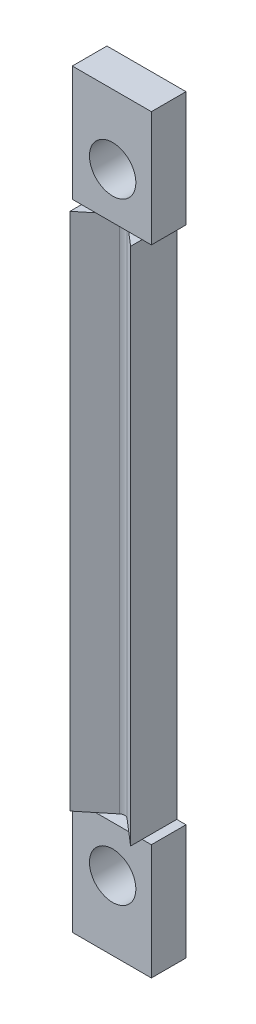
ISO-10303-21;
HEADER;
FILE_DESCRIPTION(('STEP AP214'),'2;1');
FILE_NAME('part.step','',(''),(''),'','','');
FILE_SCHEMA(('AUTOMOTIVE_DESIGN { 1 0 10303 214 1 1 1 1 }'));
ENDSEC;
DATA;
#1=APPLICATION_CONTEXT('core data for automotive mechanical design processes');
#2=APPLICATION_PROTOCOL_DEFINITION('international standard','automotive_design',2000,#1);
#3=PRODUCT_CONTEXT('',#1,'mechanical');
#4=PRODUCT('Part','Part','',(#3));
#5=PRODUCT_RELATED_PRODUCT_CATEGORY('part','',(#4));
#6=PRODUCT_DEFINITION_FORMATION('','',#4);
#7=PRODUCT_DEFINITION_CONTEXT('part definition',#1,'design');
#8=PRODUCT_DEFINITION('design','',#6,#7);
#9=PRODUCT_DEFINITION_SHAPE('','',#8);
#10=(LENGTH_UNIT() NAMED_UNIT(*) SI_UNIT(.MILLI.,.METRE.));
#11=(NAMED_UNIT(*) PLANE_ANGLE_UNIT() SI_UNIT($,.RADIAN.));
#12=(NAMED_UNIT(*) SI_UNIT($,.STERADIAN.) SOLID_ANGLE_UNIT());
#13=UNCERTAINTY_MEASURE_WITH_UNIT(LENGTH_MEASURE(1.E-05),#10,'distance_accuracy_value','');
#14=(GEOMETRIC_REPRESENTATION_CONTEXT(3) GLOBAL_UNCERTAINTY_ASSIGNED_CONTEXT((#13)) GLOBAL_UNIT_ASSIGNED_CONTEXT((#10,
#11,#12)) REPRESENTATION_CONTEXT('',''));
#15=CARTESIAN_POINT('',(0.,0.,0.));
#16=DIRECTION('',(0.,0.,1.));
#17=DIRECTION('',(1.,0.,0.));
#18=AXIS2_PLACEMENT_3D('',#15,#16,#17);
#19=CARTESIAN_POINT('',(0.,-22.5,0.));
#20=DIRECTION('',(0.,-1.,0.));
#21=DIRECTION('',(0.,0.,-1.));
#22=AXIS2_PLACEMENT_3D('',#19,#20,#21);
#23=PLANE('',#22);
#24=DIRECTION('',(-1.,0.,0.));
#25=VECTOR('',#24,1.);
#26=CARTESIAN_POINT('',(-3.49457677044796,-22.5,1.2));
#27=LINE('',#26,#25);
#28=CARTESIAN_POINT('',(2.55542322955204,-22.5,1.2));
#29=VERTEX_POINT('',#28);
#30=CARTESIAN_POINT('',(1.39386721611929,-22.5,1.2));
#31=VERTEX_POINT('',#30);
#32=EDGE_CURVE('E272',#29,#31,#27,.T.);
#33=ORIENTED_EDGE('',*,*,#32,.F.);
#34=DIRECTION('',(0.,0.,-1.));
#35=VECTOR('',#34,1.);
#36=CARTESIAN_POINT('',(2.55542322955204,-22.5,-1.8));
#37=LINE('',#36,#35);
#38=CARTESIAN_POINT('',(2.55542322955204,-22.5,2.2));
#39=VERTEX_POINT('',#38);
#40=EDGE_CURVE('E250',#39,#29,#37,.T.);
#41=ORIENTED_EDGE('',*,*,#40,.F.);
#42=DIRECTION('',(0.757842606160636,0.,0.652437417908918));
#43=VECTOR('',#42,1.);
#44=CARTESIAN_POINT('',(0.,-22.5,0.));
#45=LINE('',#44,#43);
#46=EDGE_CURVE('E231',#31,#39,#45,.T.);
#47=ORIENTED_EDGE('',*,*,#46,.F.);
#48=EDGE_LOOP('',(#33,#41,#47));
#49=FACE_BOUND('',#48,.T.);
#50=ADVANCED_FACE('F37',(#49),#23,.T.);
#51=CARTESIAN_POINT('',(0.,22.5,0.));
#52=DIRECTION('',(0.,-1.,0.));
#53=DIRECTION('',(0.,0.,-1.));
#54=AXIS2_PLACEMENT_3D('',#51,#52,#53);
#55=PLANE('',#54);
#56=DIRECTION('',(1.,0.,0.));
#57=VECTOR('',#56,1.);
#58=CARTESIAN_POINT('',(-3.49457677044796,22.5,1.2));
#59=LINE('',#58,#57);
#60=CARTESIAN_POINT('',(-2.69457677044796,22.5,1.2));
#61=VERTEX_POINT('',#60);
#62=CARTESIAN_POINT('',(-1.46976914751707,22.5,1.2));
#63=VERTEX_POINT('',#62);
#64=EDGE_CURVE('E341',#61,#63,#59,.T.);
#65=ORIENTED_EDGE('',*,*,#64,.F.);
#66=DIRECTION('',(0.,0.,1.));
#67=VECTOR('',#66,1.);
#68=CARTESIAN_POINT('',(-2.69457677044796,22.5,2.2));
#69=LINE('',#68,#67);
#70=CARTESIAN_POINT('',(-2.69457677044796,22.5,2.2));
#71=VERTEX_POINT('',#70);
#72=EDGE_CURVE('E238',#61,#71,#69,.T.);
#73=ORIENTED_EDGE('',*,*,#72,.T.);
#74=DIRECTION('',(0.774612543532737,0.,-0.632436089578815));
#75=VECTOR('',#74,1.);
#76=CARTESIAN_POINT('',(0.,22.5,0.));
#77=LINE('',#76,#75);
#78=EDGE_CURVE('E243',#71,#63,#77,.T.);
#79=ORIENTED_EDGE('',*,*,#78,.T.);
#80=EDGE_LOOP('',(#65,#73,#79));
#81=FACE_BOUND('',#80,.T.);
#82=ADVANCED_FACE('F371',(#81),#55,.F.);
#83=CARTESIAN_POINT('',(1.39386721611929,22.5,1.2));
#84=VERTEX_POINT('',#83);
#85=CARTESIAN_POINT('',(2.55542322955204,22.5,1.2));
#86=VERTEX_POINT('',#85);
#87=EDGE_CURVE('E215',#84,#86,#59,.T.);
#88=ORIENTED_EDGE('',*,*,#87,.F.);
#89=DIRECTION('',(0.757842606160636,0.,0.652437417908918));
#90=VECTOR('',#89,1.);
#91=CARTESIAN_POINT('',(0.,22.5,0.));
#92=LINE('',#91,#90);
#93=CARTESIAN_POINT('',(2.55542322955204,22.5,2.2));
#94=VERTEX_POINT('',#93);
#95=EDGE_CURVE('E235',#84,#94,#92,.T.);
#96=ORIENTED_EDGE('',*,*,#95,.T.);
#97=DIRECTION('',(0.,0.,-1.));
#98=VECTOR('',#97,1.);
#99=CARTESIAN_POINT('',(2.55542322955204,22.5,-1.8));
#100=LINE('',#99,#98);
#101=EDGE_CURVE('E236',#94,#86,#100,.T.);
#102=ORIENTED_EDGE('',*,*,#101,.T.);
#103=EDGE_LOOP('',(#88,#96,#102));
#104=FACE_BOUND('',#103,.T.);
#105=ADVANCED_FACE('F377',(#104),#55,.F.);
#106=CARTESIAN_POINT('',(0.,22.5,0.));
#107=DIRECTION('',(0.652437417908918,0.,-0.757842606160635));
#108=DIRECTION('',(-0.757842606160636,0.,-0.652437417908918));
#109=AXIS2_PLACEMENT_3D('',#106,#107,#108);
#110=PLANE('',#109);
#111=CARTESIAN_POINT('',(0.31770322534271,22.5,0.273515200015023));
#112=VERTEX_POINT('',#111);
#113=EDGE_CURVE('E232',#112,#84,#92,.T.);
#114=ORIENTED_EDGE('',*,*,#113,.F.);
#115=DIRECTION('',(0.,-1.,0.));
#116=VECTOR('',#115,1.);
#117=CARTESIAN_POINT('',(0.31770322534271,-22.5,0.273515200015023));
#118=LINE('',#117,#116);
#119=CARTESIAN_POINT('',(0.31770322534271,-22.5,0.273515200015023));
#120=VERTEX_POINT('',#119);
#121=EDGE_CURVE('E269',#112,#120,#118,.T.);
#122=ORIENTED_EDGE('',*,*,#121,.T.);
#123=EDGE_CURVE('E247',#120,#31,#45,.T.);
#124=ORIENTED_EDGE('',*,*,#123,.T.);
#125=ORIENTED_EDGE('',*,*,#46,.T.);
#126=DIRECTION('',(0.,-1.,0.));
#127=VECTOR('',#126,1.);
#128=CARTESIAN_POINT('',(2.55542322955204,22.5,2.2));
#129=LINE('',#128,#127);
#130=EDGE_CURVE('E266',#94,#39,#129,.T.);
#131=ORIENTED_EDGE('',*,*,#130,.F.);
#132=ORIENTED_EDGE('',*,*,#95,.F.);
#133=EDGE_LOOP('',(#114,#122,#124,#125,#131,#132));
#134=FACE_BOUND('',#133,.T.);
#135=ADVANCED_FACE('F334',(#134),#110,.F.);
#136=CARTESIAN_POINT('',(2.55542322955204,22.5,-1.8));
#137=DIRECTION('',(-1.,0.,0.));
#138=DIRECTION('',(0.,0.,1.));
#139=AXIS2_PLACEMENT_3D('',#136,#137,#138);
#140=PLANE('',#139);
#141=ORIENTED_EDGE('',*,*,#40,.T.);
#142=CARTESIAN_POINT('',(2.55542322955204,-22.5,-1.8));
#143=VERTEX_POINT('',#142);
#144=EDGE_CURVE('E249',#29,#143,#37,.T.);
#145=ORIENTED_EDGE('',*,*,#144,.T.);
#146=DIRECTION('',(0.,-1.,0.));
#147=VECTOR('',#146,1.);
#148=CARTESIAN_POINT('',(2.55542322955204,22.5,-1.8));
#149=LINE('',#148,#147);
#150=CARTESIAN_POINT('',(2.55542322955204,22.5,-1.8));
#151=VERTEX_POINT('',#150);
#152=EDGE_CURVE('E264',#151,#143,#149,.T.);
#153=ORIENTED_EDGE('',*,*,#152,.F.);
#154=EDGE_CURVE('E234',#86,#151,#100,.T.);
#155=ORIENTED_EDGE('',*,*,#154,.F.);
#156=ORIENTED_EDGE('',*,*,#101,.F.);
#157=ORIENTED_EDGE('',*,*,#130,.T.);
#158=EDGE_LOOP('',(#141,#145,#153,#155,#156,#157));
#159=FACE_BOUND('',#158,.T.);
#160=ADVANCED_FACE('F315',(#159),#140,.F.);
#161=CARTESIAN_POINT('',(-2.69457677044796,22.5,-1.8));
#162=DIRECTION('',(0.,0.,1.));
#163=DIRECTION('',(1.,0.,0.));
#164=AXIS2_PLACEMENT_3D('',#161,#162,#163);
#165=PLANE('',#164);
#166=CARTESIAN_POINT('',(0.,-26.5,-1.8));
#167=DIRECTION('',(0.,0.,-1.));
#168=DIRECTION('',(-1.,0.,0.));
#169=AXIS2_PLACEMENT_3D('',#166,#167,#168);
#170=CIRCLE('',#169,2.01);
#171=CARTESIAN_POINT('',(-2.01000000000001,-26.5,-1.8));
#172=VERTEX_POINT('',#171);
#173=EDGE_CURVE('E276',#172,#172,#170,.T.);
#174=ORIENTED_EDGE('',*,*,#173,.F.);
#175=EDGE_LOOP('',(#174));
#176=FACE_BOUND('',#175,.T.);
#177=CARTESIAN_POINT('',(0.,26.5,-1.8));
#178=DIRECTION('',(0.,0.,-1.));
#179=DIRECTION('',(-1.,0.,0.));
#180=AXIS2_PLACEMENT_3D('',#177,#178,#179);
#181=CIRCLE('',#180,2.01);
#182=CARTESIAN_POINT('',(-2.00999999999999,26.5,-1.8));
#183=VERTEX_POINT('',#182);
#184=EDGE_CURVE('E281',#183,#183,#181,.T.);
#185=ORIENTED_EDGE('',*,*,#184,.F.);
#186=EDGE_LOOP('',(#185));
#187=FACE_BOUND('',#186,.T.);
#188=ORIENTED_EDGE('',*,*,#152,.T.);
#189=DIRECTION('',(1.,0.,0.));
#190=VECTOR('',#189,1.);
#191=CARTESIAN_POINT('',(-3.49457677044796,-22.5,-1.8));
#192=LINE('',#191,#190);
#193=CARTESIAN_POINT('',(3.35542322955204,-22.5,-1.8));
#194=VERTEX_POINT('',#193);
#195=EDGE_CURVE('E292',#143,#194,#192,.T.);
#196=ORIENTED_EDGE('',*,*,#195,.T.);
#197=DIRECTION('',(0.,1.,0.));
#198=VECTOR('',#197,1.);
#199=CARTESIAN_POINT('',(3.35542322955204,-32.5,-1.8));
#200=LINE('',#199,#198);
#201=CARTESIAN_POINT('',(3.35542322955204,-32.5,-1.8));
#202=VERTEX_POINT('',#201);
#203=EDGE_CURVE('E172',#202,#194,#200,.T.);
#204=ORIENTED_EDGE('',*,*,#203,.F.);
#205=DIRECTION('',(1.,0.,0.));
#206=VECTOR('',#205,1.);
#207=CARTESIAN_POINT('',(-3.49457677044796,-32.5,-1.8));
#208=LINE('',#207,#206);
#209=CARTESIAN_POINT('',(-3.49457677044796,-32.5,-1.8));
#210=VERTEX_POINT('',#209);
#211=EDGE_CURVE('E163',#210,#202,#208,.T.);
#212=ORIENTED_EDGE('',*,*,#211,.F.);
#213=DIRECTION('',(0.,1.,0.));
#214=VECTOR('',#213,1.);
#215=CARTESIAN_POINT('',(-3.49457677044796,-32.5,-1.8));
#216=LINE('',#215,#214);
#217=CARTESIAN_POINT('',(-3.49457677044796,-22.5,-1.8));
#218=VERTEX_POINT('',#217);
#219=EDGE_CURVE('E169',#210,#218,#216,.T.);
#220=ORIENTED_EDGE('',*,*,#219,.T.);
#221=CARTESIAN_POINT('',(-2.69457677044796,-22.5,-1.8));
#222=VERTEX_POINT('',#221);
#223=EDGE_CURVE('E293',#218,#222,#192,.T.);
#224=ORIENTED_EDGE('',*,*,#223,.T.);
#225=DIRECTION('',(0.,-1.,0.));
#226=VECTOR('',#225,1.);
#227=CARTESIAN_POINT('',(-2.69457677044796,22.5,-1.8));
#228=LINE('',#227,#226);
#229=CARTESIAN_POINT('',(-2.69457677044796,22.5,-1.8));
#230=VERTEX_POINT('',#229);
#231=EDGE_CURVE('E262',#230,#222,#228,.T.);
#232=ORIENTED_EDGE('',*,*,#231,.F.);
#233=DIRECTION('',(-1.,0.,0.));
#234=VECTOR('',#233,1.);
#235=CARTESIAN_POINT('',(-3.49457677044796,22.5,-1.8));
#236=LINE('',#235,#234);
#237=CARTESIAN_POINT('',(-3.49457677044796,22.5,-1.8));
#238=VERTEX_POINT('',#237);
#239=EDGE_CURVE('E217',#230,#238,#236,.T.);
#240=ORIENTED_EDGE('',*,*,#239,.T.);
#241=DIRECTION('',(0.,-1.,0.));
#242=VECTOR('',#241,1.);
#243=CARTESIAN_POINT('',(-3.49457677044796,32.5,-1.8));
#244=LINE('',#243,#242);
#245=CARTESIAN_POINT('',(-3.49457677044796,32.5,-1.8));
#246=VERTEX_POINT('',#245);
#247=EDGE_CURVE('E208',#246,#238,#244,.T.);
#248=ORIENTED_EDGE('',*,*,#247,.F.);
#249=DIRECTION('',(-1.,0.,0.));
#250=VECTOR('',#249,1.);
#251=CARTESIAN_POINT('',(-3.49457677044796,32.5,-1.8));
#252=LINE('',#251,#250);
#253=CARTESIAN_POINT('',(3.35542322955204,32.5,-1.8));
#254=VERTEX_POINT('',#253);
#255=EDGE_CURVE('E207',#254,#246,#252,.T.);
#256=ORIENTED_EDGE('',*,*,#255,.F.);
#257=DIRECTION('',(0.,-1.,0.));
#258=VECTOR('',#257,1.);
#259=CARTESIAN_POINT('',(3.35542322955204,32.5,-1.8));
#260=LINE('',#259,#258);
#261=CARTESIAN_POINT('',(3.35542322955204,22.5,-1.8));
#262=VERTEX_POINT('',#261);
#263=EDGE_CURVE('E222',#254,#262,#260,.T.);
#264=ORIENTED_EDGE('',*,*,#263,.T.);
#265=EDGE_CURVE('E203',#262,#151,#236,.T.);
#266=ORIENTED_EDGE('',*,*,#265,.T.);
#267=EDGE_LOOP('',(#188,#196,#204,#212,#220,#224,#232,#240,#248,#256,#264,#266));
#268=FACE_BOUND('',#267,.T.);
#269=ADVANCED_FACE('F166',(#176,#187,#268),#165,.F.);
#270=CARTESIAN_POINT('',(-2.69457677044796,22.5,2.2));
#271=DIRECTION('',(1.,0.,0.));
#272=DIRECTION('',(0.,0.,-1.));
#273=AXIS2_PLACEMENT_3D('',#270,#271,#272);
#274=PLANE('',#273);
#275=DIRECTION('',(0.,0.,1.));
#276=VECTOR('',#275,1.);
#277=CARTESIAN_POINT('',(-2.69457677044796,-22.5,2.2));
#278=LINE('',#277,#276);
#279=CARTESIAN_POINT('',(-2.69457677044796,-22.5,1.2));
#280=VERTEX_POINT('',#279);
#281=EDGE_CURVE('E254',#222,#280,#278,.T.);
#282=ORIENTED_EDGE('',*,*,#281,.T.);
#283=CARTESIAN_POINT('',(-2.69457677044796,-22.5,2.2));
#284=VERTEX_POINT('',#283);
#285=EDGE_CURVE('E253',#280,#284,#278,.T.);
#286=ORIENTED_EDGE('',*,*,#285,.T.);
#287=DIRECTION('',(0.,-1.,0.));
#288=VECTOR('',#287,1.);
#289=CARTESIAN_POINT('',(-2.69457677044796,22.5,2.2));
#290=LINE('',#289,#288);
#291=EDGE_CURVE('E246',#71,#284,#290,.T.);
#292=ORIENTED_EDGE('',*,*,#291,.F.);
#293=ORIENTED_EDGE('',*,*,#72,.F.);
#294=EDGE_CURVE('E239',#230,#61,#69,.T.);
#295=ORIENTED_EDGE('',*,*,#294,.F.);
#296=ORIENTED_EDGE('',*,*,#231,.T.);
#297=EDGE_LOOP('',(#282,#286,#292,#293,#295,#296));
#298=FACE_BOUND('',#297,.T.);
#299=ADVANCED_FACE('F351',(#298),#274,.F.);
#300=CARTESIAN_POINT('',(0.,22.5,0.));
#301=DIRECTION('',(-0.632436089578815,0.,-0.774612543532737));
#302=DIRECTION('',(-0.774612543532737,0.,0.632436089578815));
#303=AXIS2_PLACEMENT_3D('',#300,#301,#302);
#304=PLANE('',#303);
#305=DIRECTION('',(0.774612543532737,0.,-0.632436089578815));
#306=VECTOR('',#305,1.);
#307=CARTESIAN_POINT('',(0.,-22.5,0.));
#308=LINE('',#307,#306);
#309=CARTESIAN_POINT('',(-1.46976914751707,-22.5,1.2));
#310=VERTEX_POINT('',#309);
#311=CARTESIAN_POINT('',(-0.324733528401156,-22.5,0.265130231328973));
#312=VERTEX_POINT('',#311);
#313=EDGE_CURVE('E256',#310,#312,#308,.T.);
#314=ORIENTED_EDGE('',*,*,#313,.T.);
#315=DIRECTION('',(0.,-1.,0.));
#316=VECTOR('',#315,1.);
#317=CARTESIAN_POINT('',(-0.324733528401156,22.5,0.265130231328973));
#318=LINE('',#317,#316);
#319=CARTESIAN_POINT('',(-0.324733528401156,22.5,0.265130231328973));
#320=VERTEX_POINT('',#319);
#321=EDGE_CURVE('E46',#312,#320,#318,.F.);
#322=ORIENTED_EDGE('',*,*,#321,.T.);
#323=EDGE_CURVE('E242',#63,#320,#77,.T.);
#324=ORIENTED_EDGE('',*,*,#323,.F.);
#325=ORIENTED_EDGE('',*,*,#78,.F.);
#326=ORIENTED_EDGE('',*,*,#291,.T.);
#327=EDGE_CURVE('E257',#284,#310,#308,.T.);
#328=ORIENTED_EDGE('',*,*,#327,.T.);
#329=EDGE_LOOP('',(#314,#322,#324,#325,#326,#328));
#330=FACE_BOUND('',#329,.T.);
#331=ADVANCED_FACE('F392',(#330),#304,.F.);
#332=EDGE_CURVE('E301',#310,#280,#27,.T.);
#333=ORIENTED_EDGE('',*,*,#332,.F.);
#334=ORIENTED_EDGE('',*,*,#327,.F.);
#335=ORIENTED_EDGE('',*,*,#285,.F.);
#336=EDGE_LOOP('',(#333,#334,#335));
#337=FACE_BOUND('',#336,.T.);
#338=ADVANCED_FACE('F387',(#337),#23,.T.);
#339=CARTESIAN_POINT('',(0.,22.5,0.));
#340=DIRECTION('',(0.,1.,0.));
#341=DIRECTION('',(0.,0.,1.));
#342=AXIS2_PLACEMENT_3D('',#339,#340,#341);
#343=PLANE('',#342);
#344=CARTESIAN_POINT('',(3.35542322955204,22.5,1.2));
#345=VERTEX_POINT('',#344);
#346=EDGE_CURVE('E193',#86,#345,#59,.T.);
#347=ORIENTED_EDGE('',*,*,#346,.F.);
#348=ORIENTED_EDGE('',*,*,#154,.T.);
#349=ORIENTED_EDGE('',*,*,#265,.F.);
#350=DIRECTION('',(0.,0.,-1.));
#351=VECTOR('',#350,1.);
#352=CARTESIAN_POINT('',(3.35542322955204,22.5,-1.8));
#353=LINE('',#352,#351);
#354=EDGE_CURVE('E213',#345,#262,#353,.T.);
#355=ORIENTED_EDGE('',*,*,#354,.F.);
#356=EDGE_LOOP('',(#347,#348,#349,#355));
#357=FACE_BOUND('',#356,.T.);
#358=ADVANCED_FACE('F325',(#357),#343,.F.);
#359=ORIENTED_EDGE('',*,*,#239,.F.);
#360=ORIENTED_EDGE('',*,*,#294,.T.);
#361=CARTESIAN_POINT('',(-3.49457677044796,22.5,1.2));
#362=VERTEX_POINT('',#361);
#363=EDGE_CURVE('E210',#362,#61,#59,.T.);
#364=ORIENTED_EDGE('',*,*,#363,.F.);
#365=DIRECTION('',(0.,0.,1.));
#366=VECTOR('',#365,1.);
#367=CARTESIAN_POINT('',(-3.49457677044796,22.5,-1.8));
#368=LINE('',#367,#366);
#369=EDGE_CURVE('E190',#238,#362,#368,.T.);
#370=ORIENTED_EDGE('',*,*,#369,.F.);
#371=EDGE_LOOP('',(#359,#360,#364,#370));
#372=FACE_BOUND('',#371,.T.);
#373=ADVANCED_FACE('F355',(#372),#343,.F.);
#374=ORIENTED_EDGE('',*,*,#323,.T.);
#375=CARTESIAN_POINT('',(-0.00851548361174875,22.5,0.652436503095341));
#376=DIRECTION('',(0.,1.,0.));
#377=DIRECTION('',(0.,0.,1.));
#378=AXIS2_PLACEMENT_3D('',#375,#376,#377);
#379=CIRCLE('',#378,0.5);
#380=EDGE_CURVE('E11',#320,#112,#379,.F.);
#381=ORIENTED_EDGE('',*,*,#380,.T.);
#382=ORIENTED_EDGE('',*,*,#113,.T.);
#383=EDGE_CURVE('E214',#63,#84,#59,.T.);
#384=ORIENTED_EDGE('',*,*,#383,.F.);
#385=EDGE_LOOP('',(#374,#381,#382,#384));
#386=FACE_BOUND('',#385,.T.);
#387=ADVANCED_FACE('F374',(#386),#343,.F.);
#388=CARTESIAN_POINT('',(-3.49457677044796,32.5,-1.8));
#389=DIRECTION('',(1.,0.,0.));
#390=DIRECTION('',(0.,0.,-1.));
#391=AXIS2_PLACEMENT_3D('',#388,#389,#390);
#392=PLANE('',#391);
#393=ORIENTED_EDGE('',*,*,#369,.T.);
#394=DIRECTION('',(0.,-1.,0.));
#395=VECTOR('',#394,1.);
#396=CARTESIAN_POINT('',(-3.49457677044796,32.5,1.2));
#397=LINE('',#396,#395);
#398=CARTESIAN_POINT('',(-3.49457677044796,32.5,1.2));
#399=VERTEX_POINT('',#398);
#400=EDGE_CURVE('E228',#399,#362,#397,.T.);
#401=ORIENTED_EDGE('',*,*,#400,.F.);
#402=DIRECTION('',(0.,0.,1.));
#403=VECTOR('',#402,1.);
#404=CARTESIAN_POINT('',(-3.49457677044796,32.5,-1.8));
#405=LINE('',#404,#403);
#406=EDGE_CURVE('E199',#246,#399,#405,.T.);
#407=ORIENTED_EDGE('',*,*,#406,.F.);
#408=ORIENTED_EDGE('',*,*,#247,.T.);
#409=EDGE_LOOP('',(#393,#401,#407,#408));
#410=FACE_BOUND('',#409,.T.);
#411=ADVANCED_FACE('F358',(#410),#392,.F.);
#412=CARTESIAN_POINT('',(-3.49457677044796,32.5,1.2));
#413=DIRECTION('',(0.,0.,-1.));
#414=DIRECTION('',(-1.,0.,0.));
#415=AXIS2_PLACEMENT_3D('',#412,#413,#414);
#416=PLANE('',#415);
#417=CARTESIAN_POINT('',(0.,26.5,1.2));
#418=DIRECTION('',(0.,0.,-1.));
#419=DIRECTION('',(-1.,0.,0.));
#420=AXIS2_PLACEMENT_3D('',#417,#418,#419);
#421=CIRCLE('',#420,2.01);
#422=CARTESIAN_POINT('',(-2.00999999999999,26.5,1.2));
#423=VERTEX_POINT('',#422);
#424=EDGE_CURVE('E41',#423,#423,#421,.T.);
#425=ORIENTED_EDGE('',*,*,#424,.T.);
#426=EDGE_LOOP('',(#425));
#427=FACE_BOUND('',#426,.T.);
#428=ORIENTED_EDGE('',*,*,#363,.T.);
#429=ORIENTED_EDGE('',*,*,#64,.T.);
#430=ORIENTED_EDGE('',*,*,#383,.T.);
#431=ORIENTED_EDGE('',*,*,#87,.T.);
#432=ORIENTED_EDGE('',*,*,#346,.T.);
#433=DIRECTION('',(0.,-1.,0.));
#434=VECTOR('',#433,1.);
#435=CARTESIAN_POINT('',(3.35542322955204,32.5,1.2));
#436=LINE('',#435,#434);
#437=CARTESIAN_POINT('',(3.35542322955204,32.5,1.2));
#438=VERTEX_POINT('',#437);
#439=EDGE_CURVE('E225',#438,#345,#436,.T.);
#440=ORIENTED_EDGE('',*,*,#439,.F.);
#441=DIRECTION('',(1.,0.,0.));
#442=VECTOR('',#441,1.);
#443=CARTESIAN_POINT('',(-3.49457677044796,32.5,1.2));
#444=LINE('',#443,#442);
#445=EDGE_CURVE('E202',#399,#438,#444,.T.);
#446=ORIENTED_EDGE('',*,*,#445,.F.);
#447=ORIENTED_EDGE('',*,*,#400,.T.);
#448=EDGE_LOOP('',(#428,#429,#430,#431,#432,#440,#446,#447));
#449=FACE_BOUND('',#448,.T.);
#450=ADVANCED_FACE('F367',(#427,#449),#416,.F.);
#451=CARTESIAN_POINT('',(3.35542322955204,32.5,-1.8));
#452=DIRECTION('',(-1.,0.,0.));
#453=DIRECTION('',(0.,0.,1.));
#454=AXIS2_PLACEMENT_3D('',#451,#452,#453);
#455=PLANE('',#454);
#456=ORIENTED_EDGE('',*,*,#354,.T.);
#457=ORIENTED_EDGE('',*,*,#263,.F.);
#458=DIRECTION('',(0.,0.,-1.));
#459=VECTOR('',#458,1.);
#460=CARTESIAN_POINT('',(3.35542322955204,32.5,-1.8));
#461=LINE('',#460,#459);
#462=EDGE_CURVE('E205',#438,#254,#461,.T.);
#463=ORIENTED_EDGE('',*,*,#462,.F.);
#464=ORIENTED_EDGE('',*,*,#439,.T.);
#465=EDGE_LOOP('',(#456,#457,#463,#464));
#466=FACE_BOUND('',#465,.T.);
#467=ADVANCED_FACE('F365',(#466),#455,.F.);
#468=CARTESIAN_POINT('',(0.,32.5,0.));
#469=DIRECTION('',(0.,1.,0.));
#470=DIRECTION('',(0.,0.,1.));
#471=AXIS2_PLACEMENT_3D('',#468,#469,#470);
#472=PLANE('',#471);
#473=ORIENTED_EDGE('',*,*,#406,.T.);
#474=ORIENTED_EDGE('',*,*,#445,.T.);
#475=ORIENTED_EDGE('',*,*,#462,.T.);
#476=ORIENTED_EDGE('',*,*,#255,.T.);
#477=EDGE_LOOP('',(#473,#474,#475,#476));
#478=FACE_BOUND('',#477,.T.);
#479=ADVANCED_FACE('F361',(#478),#472,.T.);
#480=CARTESIAN_POINT('',(0.,-22.5,0.));
#481=DIRECTION('',(0.,1.,0.));
#482=DIRECTION('',(0.,0.,1.));
#483=AXIS2_PLACEMENT_3D('',#480,#481,#482);
#484=PLANE('',#483);
#485=ORIENTED_EDGE('',*,*,#123,.F.);
#486=CARTESIAN_POINT('',(-0.00851548361174875,-22.5,0.652436503095341));
#487=DIRECTION('',(0.,1.,0.));
#488=DIRECTION('',(0.,0.,1.));
#489=AXIS2_PLACEMENT_3D('',#486,#487,#488);
#490=CIRCLE('',#489,0.5);
#491=EDGE_CURVE('E61',#120,#312,#490,.T.);
#492=ORIENTED_EDGE('',*,*,#491,.T.);
#493=ORIENTED_EDGE('',*,*,#313,.F.);
#494=EDGE_CURVE('E300',#31,#310,#27,.T.);
#495=ORIENTED_EDGE('',*,*,#494,.F.);
#496=EDGE_LOOP('',(#485,#492,#493,#495));
#497=FACE_BOUND('',#496,.T.);
#498=ADVANCED_FACE('F401',(#497),#484,.T.);
#499=ORIENTED_EDGE('',*,*,#281,.F.);
#500=ORIENTED_EDGE('',*,*,#223,.F.);
#501=DIRECTION('',(0.,0.,-1.));
#502=VECTOR('',#501,1.);
#503=CARTESIAN_POINT('',(-3.49457677044796,-22.5,-1.8));
#504=LINE('',#503,#502);
#505=CARTESIAN_POINT('',(-3.49457677044796,-22.5,1.2));
#506=VERTEX_POINT('',#505);
#507=EDGE_CURVE('E189',#506,#218,#504,.T.);
#508=ORIENTED_EDGE('',*,*,#507,.F.);
#509=EDGE_CURVE('E297',#280,#506,#27,.T.);
#510=ORIENTED_EDGE('',*,*,#509,.F.);
#511=EDGE_LOOP('',(#499,#500,#508,#510));
#512=FACE_BOUND('',#511,.T.);
#513=ADVANCED_FACE('F345',(#512),#484,.T.);
#514=ORIENTED_EDGE('',*,*,#144,.F.);
#515=CARTESIAN_POINT('',(3.35542322955204,-22.5,1.2));
#516=VERTEX_POINT('',#515);
#517=EDGE_CURVE('E185',#516,#29,#27,.T.);
#518=ORIENTED_EDGE('',*,*,#517,.F.);
#519=DIRECTION('',(0.,0.,1.));
#520=VECTOR('',#519,1.);
#521=CARTESIAN_POINT('',(3.35542322955204,-22.5,-1.8));
#522=LINE('',#521,#520);
#523=EDGE_CURVE('E295',#194,#516,#522,.T.);
#524=ORIENTED_EDGE('',*,*,#523,.F.);
#525=ORIENTED_EDGE('',*,*,#195,.F.);
#526=EDGE_LOOP('',(#514,#518,#524,#525));
#527=FACE_BOUND('',#526,.T.);
#528=ADVANCED_FACE('F312',(#527),#484,.T.);
#529=CARTESIAN_POINT('',(-3.49457677044796,-32.5,-1.8));
#530=DIRECTION('',(1.,0.,0.));
#531=DIRECTION('',(0.,0.,-1.));
#532=AXIS2_PLACEMENT_3D('',#529,#530,#531);
#533=PLANE('',#532);
#534=ORIENTED_EDGE('',*,*,#507,.T.);
#535=ORIENTED_EDGE('',*,*,#219,.F.);
#536=DIRECTION('',(0.,0.,-1.));
#537=VECTOR('',#536,1.);
#538=CARTESIAN_POINT('',(-3.49457677044796,-32.5,-1.8));
#539=LINE('',#538,#537);
#540=CARTESIAN_POINT('',(-3.49457677044796,-32.5,1.2));
#541=VERTEX_POINT('',#540);
#542=EDGE_CURVE('E176',#541,#210,#539,.T.);
#543=ORIENTED_EDGE('',*,*,#542,.F.);
#544=DIRECTION('',(0.,1.,0.));
#545=VECTOR('',#544,1.);
#546=CARTESIAN_POINT('',(-3.49457677044796,-32.5,1.2));
#547=LINE('',#546,#545);
#548=EDGE_CURVE('E290',#541,#506,#547,.T.);
#549=ORIENTED_EDGE('',*,*,#548,.T.);
#550=EDGE_LOOP('',(#534,#535,#543,#549));
#551=FACE_BOUND('',#550,.T.);
#552=ADVANCED_FACE('F187',(#551),#533,.F.);
#553=CARTESIAN_POINT('',(3.35542322955204,-32.5,-1.8));
#554=DIRECTION('',(-1.,0.,0.));
#555=DIRECTION('',(0.,0.,1.));
#556=AXIS2_PLACEMENT_3D('',#553,#554,#555);
#557=PLANE('',#556);
#558=ORIENTED_EDGE('',*,*,#523,.T.);
#559=DIRECTION('',(0.,1.,0.));
#560=VECTOR('',#559,1.);
#561=CARTESIAN_POINT('',(3.35542322955204,-32.5,1.2));
#562=LINE('',#561,#560);
#563=CARTESIAN_POINT('',(3.35542322955204,-32.5,1.2));
#564=VERTEX_POINT('',#563);
#565=EDGE_CURVE('E195',#564,#516,#562,.T.);
#566=ORIENTED_EDGE('',*,*,#565,.F.);
#567=DIRECTION('',(0.,0.,1.));
#568=VECTOR('',#567,1.);
#569=CARTESIAN_POINT('',(3.35542322955204,-32.5,-1.8));
#570=LINE('',#569,#568);
#571=EDGE_CURVE('E175',#202,#564,#570,.T.);
#572=ORIENTED_EDGE('',*,*,#571,.F.);
#573=ORIENTED_EDGE('',*,*,#203,.T.);
#574=EDGE_LOOP('',(#558,#566,#572,#573));
#575=FACE_BOUND('',#574,.T.);
#576=ADVANCED_FACE('F415',(#575),#557,.F.);
#577=CARTESIAN_POINT('',(-3.49457677044796,-32.5,1.2));
#578=DIRECTION('',(0.,0.,-1.));
#579=DIRECTION('',(-1.,0.,0.));
#580=AXIS2_PLACEMENT_3D('',#577,#578,#579);
#581=PLANE('',#580);
#582=CARTESIAN_POINT('',(0.,-26.5,1.2));
#583=DIRECTION('',(0.,0.,-1.));
#584=DIRECTION('',(-1.,0.,0.));
#585=AXIS2_PLACEMENT_3D('',#582,#583,#584);
#586=CIRCLE('',#585,2.01);
#587=CARTESIAN_POINT('',(-2.01000000000001,-26.5,1.2));
#588=VERTEX_POINT('',#587);
#589=EDGE_CURVE('E274',#588,#588,#586,.T.);
#590=ORIENTED_EDGE('',*,*,#589,.T.);
#591=EDGE_LOOP('',(#590));
#592=FACE_BOUND('',#591,.T.);
#593=ORIENTED_EDGE('',*,*,#517,.T.);
#594=ORIENTED_EDGE('',*,*,#32,.T.);
#595=ORIENTED_EDGE('',*,*,#494,.T.);
#596=ORIENTED_EDGE('',*,*,#332,.T.);
#597=ORIENTED_EDGE('',*,*,#509,.T.);
#598=ORIENTED_EDGE('',*,*,#548,.F.);
#599=DIRECTION('',(-1.,0.,0.));
#600=VECTOR('',#599,1.);
#601=CARTESIAN_POINT('',(-3.49457677044796,-32.5,1.2));
#602=LINE('',#601,#600);
#603=EDGE_CURVE('E181',#564,#541,#602,.T.);
#604=ORIENTED_EDGE('',*,*,#603,.F.);
#605=ORIENTED_EDGE('',*,*,#565,.T.);
#606=EDGE_LOOP('',(#593,#594,#595,#596,#597,#598,#604,#605));
#607=FACE_BOUND('',#606,.T.);
#608=ADVANCED_FACE('F306',(#592,#607),#581,.F.);
#609=CARTESIAN_POINT('',(0.,-32.5,0.));
#610=DIRECTION('',(0.,1.,0.));
#611=DIRECTION('',(0.,0.,1.));
#612=AXIS2_PLACEMENT_3D('',#609,#610,#611);
#613=PLANE('',#612);
#614=ORIENTED_EDGE('',*,*,#542,.T.);
#615=ORIENTED_EDGE('',*,*,#211,.T.);
#616=ORIENTED_EDGE('',*,*,#571,.T.);
#617=ORIENTED_EDGE('',*,*,#603,.T.);
#618=EDGE_LOOP('',(#614,#615,#616,#617));
#619=FACE_BOUND('',#618,.T.);
#620=ADVANCED_FACE('F179',(#619),#613,.F.);
#621=CARTESIAN_POINT('',(-0.00851548361174875,22.5,0.652436503095341));
#622=DIRECTION('',(0.,1.,0.));
#623=DIRECTION('',(0.,0.,1.));
#624=AXIS2_PLACEMENT_3D('',#621,#622,#623);
#625=CYLINDRICAL_SURFACE('',#624,0.5);
#626=ORIENTED_EDGE('',*,*,#380,.F.);
#627=ORIENTED_EDGE('',*,*,#321,.F.);
#628=ORIENTED_EDGE('',*,*,#491,.F.);
#629=ORIENTED_EDGE('',*,*,#121,.F.);
#630=EDGE_LOOP('',(#626,#627,#628,#629));
#631=FACE_BOUND('',#630,.T.);
#632=ADVANCED_FACE('F39',(#631),#625,.F.);
#633=CARTESIAN_POINT('',(0.,-26.5,8.2));
#634=DIRECTION('',(0.,0.,-1.));
#635=DIRECTION('',(-1.,0.,0.));
#636=AXIS2_PLACEMENT_3D('',#633,#634,#635);
#637=CYLINDRICAL_SURFACE('',#636,2.01);
#638=ORIENTED_EDGE('',*,*,#173,.T.);
#639=EDGE_LOOP('',(#638));
#640=FACE_BOUND('',#639,.T.);
#641=ORIENTED_EDGE('',*,*,#589,.F.);
#642=EDGE_LOOP('',(#641));
#643=FACE_BOUND('',#642,.T.);
#644=ADVANCED_FACE('F518',(#640,#643),#637,.F.);
#645=CARTESIAN_POINT('',(0.,26.5,8.2));
#646=DIRECTION('',(0.,0.,-1.));
#647=DIRECTION('',(-1.,0.,0.));
#648=AXIS2_PLACEMENT_3D('',#645,#646,#647);
#649=CYLINDRICAL_SURFACE('',#648,2.01);
#650=ORIENTED_EDGE('',*,*,#184,.T.);
#651=EDGE_LOOP('',(#650));
#652=FACE_BOUND('',#651,.T.);
#653=ORIENTED_EDGE('',*,*,#424,.F.);
#654=EDGE_LOOP('',(#653));
#655=FACE_BOUND('',#654,.T.);
#656=ADVANCED_FACE('F525',(#652,#655),#649,.F.);
#657=CLOSED_SHELL('',(#50,#82,#105,#135,#160,#269,#299,#331,#338,#358,#373,#387,#411,#450,#467,
#479,#498,#513,#528,#552,#576,#608,#620,#632,#644,#656));
#658=MANIFOLD_SOLID_BREP('B2',#657);
#659=ADVANCED_BREP_SHAPE_REPRESENTATION('',(#18,#658),#14);
#660=SHAPE_DEFINITION_REPRESENTATION(#9,#659);
ENDSEC;
END-ISO-10303-21;
